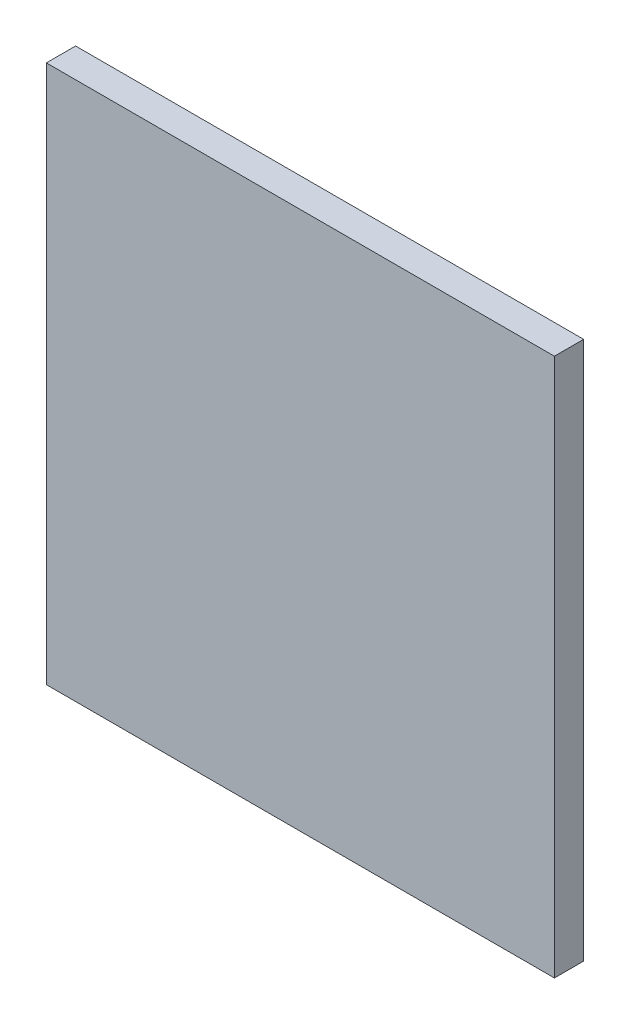
ISO-10303-21;
HEADER;
FILE_DESCRIPTION(('STEP AP214'),'2;1');
FILE_NAME('part.step','',(''),(''),'','','');
FILE_SCHEMA(('AUTOMOTIVE_DESIGN { 1 0 10303 214 1 1 1 1 }'));
ENDSEC;
DATA;
#1=APPLICATION_CONTEXT('core data for automotive mechanical design processes');
#2=APPLICATION_PROTOCOL_DEFINITION('international standard','automotive_design',2000,#1);
#3=PRODUCT_CONTEXT('',#1,'mechanical');
#4=PRODUCT('Part','Part','',(#3));
#5=PRODUCT_RELATED_PRODUCT_CATEGORY('part','',(#4));
#6=PRODUCT_DEFINITION_FORMATION('','',#4);
#7=PRODUCT_DEFINITION_CONTEXT('part definition',#1,'design');
#8=PRODUCT_DEFINITION('design','',#6,#7);
#9=PRODUCT_DEFINITION_SHAPE('','',#8);
#10=(LENGTH_UNIT() NAMED_UNIT(*) SI_UNIT(.MILLI.,.METRE.));
#11=(NAMED_UNIT(*) PLANE_ANGLE_UNIT() SI_UNIT($,.RADIAN.));
#12=(NAMED_UNIT(*) SI_UNIT($,.STERADIAN.) SOLID_ANGLE_UNIT());
#13=UNCERTAINTY_MEASURE_WITH_UNIT(LENGTH_MEASURE(1.E-05),#10,'distance_accuracy_value','');
#14=(GEOMETRIC_REPRESENTATION_CONTEXT(3) GLOBAL_UNCERTAINTY_ASSIGNED_CONTEXT((#13)) GLOBAL_UNIT_ASSIGNED_CONTEXT((#10,
#11,#12)) REPRESENTATION_CONTEXT('',''));
#15=CARTESIAN_POINT('',(0.,0.,0.));
#16=DIRECTION('',(0.,0.,1.));
#17=DIRECTION('',(1.,0.,0.));
#18=AXIS2_PLACEMENT_3D('',#15,#16,#17);
#19=CARTESIAN_POINT('',(-80.28,-91.3291046998612,0.761999999999985));
#20=DIRECTION('',(0.,1.,0.));
#21=DIRECTION('',(0.,0.,1.));
#22=AXIS2_PLACEMENT_3D('',#19,#20,#21);
#23=PLANE('',#22);
#24=DIRECTION('',(1.,0.,0.));
#25=VECTOR('',#24,1.);
#26=CARTESIAN_POINT('',(-80.28,-91.3291046998612,0.));
#27=LINE('',#26,#25);
#28=CARTESIAN_POINT('',(-80.28,-91.3291046998612,0.));
#29=VERTEX_POINT('',#28);
#30=CARTESIAN_POINT('',(-67.04,-91.3291046998612,0.));
#31=VERTEX_POINT('',#30);
#32=EDGE_CURVE('E95',#29,#31,#27,.T.);
#33=ORIENTED_EDGE('',*,*,#32,.T.);
#34=DIRECTION('',(0.,0.,-1.));
#35=VECTOR('',#34,1.);
#36=CARTESIAN_POINT('',(-67.04,-91.3291046998612,0.761999999999985));
#37=LINE('',#36,#35);
#38=CARTESIAN_POINT('',(-67.04,-91.3291046998612,0.761999999999985));
#39=VERTEX_POINT('',#38);
#40=EDGE_CURVE('E11',#39,#31,#37,.T.);
#41=ORIENTED_EDGE('',*,*,#40,.F.);
#42=DIRECTION('',(1.,0.,0.));
#43=VECTOR('',#42,1.);
#44=CARTESIAN_POINT('',(-80.28,-91.3291046998612,0.761999999999985));
#45=LINE('',#44,#43);
#46=CARTESIAN_POINT('',(-80.28,-91.3291046998612,0.761999999999985));
#47=VERTEX_POINT('',#46);
#48=EDGE_CURVE('E83',#47,#39,#45,.T.);
#49=ORIENTED_EDGE('',*,*,#48,.F.);
#50=DIRECTION('',(0.,0.,-1.));
#51=VECTOR('',#50,1.);
#52=CARTESIAN_POINT('',(-80.28,-91.3291046998612,0.761999999999985));
#53=LINE('',#52,#51);
#54=EDGE_CURVE('E91',#47,#29,#53,.T.);
#55=ORIENTED_EDGE('',*,*,#54,.T.);
#56=EDGE_LOOP('',(#33,#41,#49,#55));
#57=FACE_BOUND('',#56,.T.);
#58=ADVANCED_FACE('F32',(#57),#23,.F.);
#59=CARTESIAN_POINT('',(-67.04,-91.3291046998612,0.761999999999985));
#60=DIRECTION('',(-1.,0.,0.));
#61=DIRECTION('',(0.,0.,1.));
#62=AXIS2_PLACEMENT_3D('',#59,#60,#61);
#63=PLANE('',#62);
#64=DIRECTION('',(0.,1.,0.));
#65=VECTOR('',#64,1.);
#66=CARTESIAN_POINT('',(-67.04,-91.3291046998612,0.));
#67=LINE('',#66,#65);
#68=CARTESIAN_POINT('',(-67.04,-77.2953546998612,0.));
#69=VERTEX_POINT('',#68);
#70=EDGE_CURVE('E87',#31,#69,#67,.T.);
#71=ORIENTED_EDGE('',*,*,#70,.T.);
#72=DIRECTION('',(0.,0.,-1.));
#73=VECTOR('',#72,1.);
#74=CARTESIAN_POINT('',(-67.04,-77.2953546998612,0.761999999999985));
#75=LINE('',#74,#73);
#76=CARTESIAN_POINT('',(-67.04,-77.2953546998612,0.761999999999985));
#77=VERTEX_POINT('',#76);
#78=EDGE_CURVE('E40',#77,#69,#75,.T.);
#79=ORIENTED_EDGE('',*,*,#78,.F.);
#80=DIRECTION('',(0.,1.,0.));
#81=VECTOR('',#80,1.);
#82=CARTESIAN_POINT('',(-67.04,-91.3291046998612,0.761999999999985));
#83=LINE('',#82,#81);
#84=EDGE_CURVE('E78',#39,#77,#83,.T.);
#85=ORIENTED_EDGE('',*,*,#84,.F.);
#86=ORIENTED_EDGE('',*,*,#40,.T.);
#87=EDGE_LOOP('',(#71,#79,#85,#86));
#88=FACE_BOUND('',#87,.T.);
#89=ADVANCED_FACE('F86',(#88),#63,.F.);
#90=CARTESIAN_POINT('',(-67.04,-77.2953546998612,0.761999999999985));
#91=DIRECTION('',(0.,-1.,0.));
#92=DIRECTION('',(0.,0.,-1.));
#93=AXIS2_PLACEMENT_3D('',#90,#91,#92);
#94=PLANE('',#93);
#95=DIRECTION('',(-1.,0.,0.));
#96=VECTOR('',#95,1.);
#97=CARTESIAN_POINT('',(-67.04,-77.2953546998612,0.));
#98=LINE('',#97,#96);
#99=CARTESIAN_POINT('',(-80.28,-77.2953546998612,0.));
#100=VERTEX_POINT('',#99);
#101=EDGE_CURVE('E65',#69,#100,#98,.T.);
#102=ORIENTED_EDGE('',*,*,#101,.T.);
#103=DIRECTION('',(0.,0.,-1.));
#104=VECTOR('',#103,1.);
#105=CARTESIAN_POINT('',(-80.28,-77.2953546998612,0.761999999999985));
#106=LINE('',#105,#104);
#107=CARTESIAN_POINT('',(-80.28,-77.2953546998612,0.761999999999985));
#108=VERTEX_POINT('',#107);
#109=EDGE_CURVE('E88',#108,#100,#106,.T.);
#110=ORIENTED_EDGE('',*,*,#109,.F.);
#111=DIRECTION('',(-1.,0.,0.));
#112=VECTOR('',#111,1.);
#113=CARTESIAN_POINT('',(-67.04,-77.2953546998612,0.761999999999985));
#114=LINE('',#113,#112);
#115=EDGE_CURVE('E81',#77,#108,#114,.T.);
#116=ORIENTED_EDGE('',*,*,#115,.F.);
#117=ORIENTED_EDGE('',*,*,#78,.T.);
#118=EDGE_LOOP('',(#102,#110,#116,#117));
#119=FACE_BOUND('',#118,.T.);
#120=ADVANCED_FACE('F89',(#119),#94,.F.);
#121=CARTESIAN_POINT('',(-80.28,-77.2953546998612,0.761999999999985));
#122=DIRECTION('',(1.,0.,0.));
#123=DIRECTION('',(0.,0.,-1.));
#124=AXIS2_PLACEMENT_3D('',#121,#122,#123);
#125=PLANE('',#124);
#126=DIRECTION('',(0.,-1.,0.));
#127=VECTOR('',#126,1.);
#128=CARTESIAN_POINT('',(-80.28,-77.2953546998612,0.));
#129=LINE('',#128,#127);
#130=EDGE_CURVE('E71',#100,#29,#129,.T.);
#131=ORIENTED_EDGE('',*,*,#130,.T.);
#132=ORIENTED_EDGE('',*,*,#54,.F.);
#133=DIRECTION('',(0.,-1.,0.));
#134=VECTOR('',#133,1.);
#135=CARTESIAN_POINT('',(-80.28,-77.2953546998612,0.761999999999985));
#136=LINE('',#135,#134);
#137=EDGE_CURVE('E48',#108,#47,#136,.T.);
#138=ORIENTED_EDGE('',*,*,#137,.F.);
#139=ORIENTED_EDGE('',*,*,#109,.T.);
#140=EDGE_LOOP('',(#131,#132,#138,#139));
#141=FACE_BOUND('',#140,.T.);
#142=ADVANCED_FACE('F102',(#141),#125,.F.);
#143=CARTESIAN_POINT('',(0.,0.,0.761999999999985));
#144=DIRECTION('',(0.,0.,1.));
#145=DIRECTION('',(1.,0.,0.));
#146=AXIS2_PLACEMENT_3D('',#143,#144,#145);
#147=PLANE('',#146);
#148=ORIENTED_EDGE('',*,*,#48,.T.);
#149=ORIENTED_EDGE('',*,*,#84,.T.);
#150=ORIENTED_EDGE('',*,*,#115,.T.);
#151=ORIENTED_EDGE('',*,*,#137,.T.);
#152=EDGE_LOOP('',(#148,#149,#150,#151));
#153=FACE_BOUND('',#152,.T.);
#154=ADVANCED_FACE('F79',(#153),#147,.T.);
#155=CARTESIAN_POINT('',(0.,0.,0.));
#156=DIRECTION('',(0.,0.,1.));
#157=DIRECTION('',(1.,0.,0.));
#158=AXIS2_PLACEMENT_3D('',#155,#156,#157);
#159=PLANE('',#158);
#160=ORIENTED_EDGE('',*,*,#32,.F.);
#161=ORIENTED_EDGE('',*,*,#130,.F.);
#162=ORIENTED_EDGE('',*,*,#101,.F.);
#163=ORIENTED_EDGE('',*,*,#70,.F.);
#164=EDGE_LOOP('',(#160,#161,#162,#163));
#165=FACE_BOUND('',#164,.T.);
#166=ADVANCED_FACE('F105',(#165),#159,.F.);
#167=CLOSED_SHELL('',(#58,#89,#120,#142,#154,#166));
#168=MANIFOLD_SOLID_BREP('B2',#167);
#169=ADVANCED_BREP_SHAPE_REPRESENTATION('',(#18,#168),#14);
#170=SHAPE_DEFINITION_REPRESENTATION(#9,#169);
ENDSEC;
END-ISO-10303-21;
